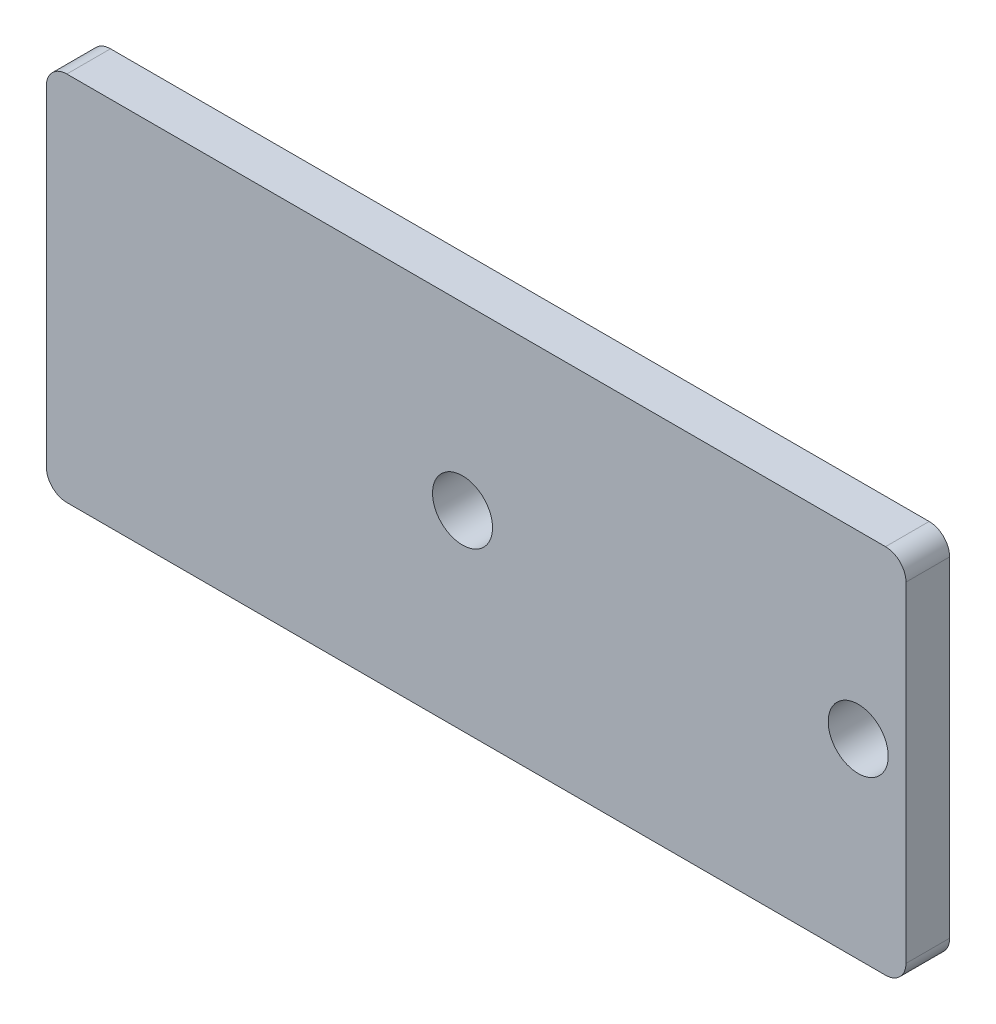
ISO-10303-21;
HEADER;
FILE_DESCRIPTION(('STEP AP214'),'2;1');
FILE_NAME('part.step','',(''),(''),'','','');
FILE_SCHEMA(('AUTOMOTIVE_DESIGN { 1 0 10303 214 1 1 1 1 }'));
ENDSEC;
DATA;
#1=APPLICATION_CONTEXT('core data for automotive mechanical design processes');
#2=APPLICATION_PROTOCOL_DEFINITION('international standard','automotive_design',2000,#1);
#3=PRODUCT_CONTEXT('',#1,'mechanical');
#4=PRODUCT('Part','Part','',(#3));
#5=PRODUCT_RELATED_PRODUCT_CATEGORY('part','',(#4));
#6=PRODUCT_DEFINITION_FORMATION('','',#4);
#7=PRODUCT_DEFINITION_CONTEXT('part definition',#1,'design');
#8=PRODUCT_DEFINITION('design','',#6,#7);
#9=PRODUCT_DEFINITION_SHAPE('','',#8);
#10=(LENGTH_UNIT() NAMED_UNIT(*) SI_UNIT(.MILLI.,.METRE.));
#11=(NAMED_UNIT(*) PLANE_ANGLE_UNIT() SI_UNIT($,.RADIAN.));
#12=(NAMED_UNIT(*) SI_UNIT($,.STERADIAN.) SOLID_ANGLE_UNIT());
#13=UNCERTAINTY_MEASURE_WITH_UNIT(LENGTH_MEASURE(1.E-05),#10,'distance_accuracy_value','');
#14=(GEOMETRIC_REPRESENTATION_CONTEXT(3) GLOBAL_UNCERTAINTY_ASSIGNED_CONTEXT((#13)) GLOBAL_UNIT_ASSIGNED_CONTEXT((#10,
#11,#12)) REPRESENTATION_CONTEXT('',''));
#15=CARTESIAN_POINT('',(0.,0.,0.));
#16=DIRECTION('',(0.,0.,1.));
#17=DIRECTION('',(1.,0.,0.));
#18=AXIS2_PLACEMENT_3D('',#15,#16,#17);
#19=CARTESIAN_POINT('',(-15.,6.05,0.8));
#20=DIRECTION('',(0.,0.,1.));
#21=DIRECTION('',(1.,0.,0.));
#22=AXIS2_PLACEMENT_3D('',#19,#20,#21);
#23=PLANE('',#22);
#24=CARTESIAN_POINT('',(-0.5,0.200000000000001,0.8));
#25=DIRECTION('',(0.,0.,1.));
#26=DIRECTION('',(1.,0.,0.));
#27=AXIS2_PLACEMENT_3D('',#24,#25,#26);
#28=CIRCLE('',#27,1.1);
#29=CARTESIAN_POINT('',(0.599999999999999,0.200000000000001,0.8));
#30=VERTEX_POINT('',#29);
#31=EDGE_CURVE('E137',#30,#30,#28,.T.);
#32=ORIENTED_EDGE('',*,*,#31,.F.);
#33=EDGE_LOOP('',(#32));
#34=FACE_BOUND('',#33,.T.);
#35=CARTESIAN_POINT('',(-15.,6.05,0.8));
#36=DIRECTION('',(0.,0.,1.));
#37=DIRECTION('',(1.,0.,0.));
#38=AXIS2_PLACEMENT_3D('',#35,#36,#37);
#39=CIRCLE('',#38,0.750000000000002);
#40=CARTESIAN_POINT('',(-15.,6.8,0.8));
#41=VERTEX_POINT('',#40);
#42=CARTESIAN_POINT('',(-15.75,6.05,0.8));
#43=VERTEX_POINT('',#42);
#44=EDGE_CURVE('E148',#41,#43,#39,.T.);
#45=ORIENTED_EDGE('',*,*,#44,.T.);
#46=DIRECTION('',(0.,-1.,0.));
#47=VECTOR('',#46,1.);
#48=CARTESIAN_POINT('',(-15.75,6.05,0.8));
#49=LINE('',#48,#47);
#50=CARTESIAN_POINT('',(-15.75,-6.05,0.8));
#51=VERTEX_POINT('',#50);
#52=EDGE_CURVE('E96',#43,#51,#49,.T.);
#53=ORIENTED_EDGE('',*,*,#52,.T.);
#54=CARTESIAN_POINT('',(-15.,-6.05,0.8));
#55=DIRECTION('',(0.,0.,1.));
#56=DIRECTION('',(-1.,0.,0.));
#57=AXIS2_PLACEMENT_3D('',#54,#55,#56);
#58=CIRCLE('',#57,0.750000000000002);
#59=CARTESIAN_POINT('',(-15.,-6.8,0.8));
#60=VERTEX_POINT('',#59);
#61=EDGE_CURVE('E163',#51,#60,#58,.T.);
#62=ORIENTED_EDGE('',*,*,#61,.T.);
#63=DIRECTION('',(1.,0.,0.));
#64=VECTOR('',#63,1.);
#65=CARTESIAN_POINT('',(-15.,-6.8,0.8));
#66=LINE('',#65,#64);
#67=CARTESIAN_POINT('',(15.,-6.8,0.8));
#68=VERTEX_POINT('',#67);
#69=EDGE_CURVE('E176',#60,#68,#66,.T.);
#70=ORIENTED_EDGE('',*,*,#69,.T.);
#71=CARTESIAN_POINT('',(15.,-6.05,0.8));
#72=DIRECTION('',(0.,0.,1.));
#73=DIRECTION('',(1.,0.,0.));
#74=AXIS2_PLACEMENT_3D('',#71,#72,#73);
#75=CIRCLE('',#74,0.750000000000002);
#76=CARTESIAN_POINT('',(15.75,-6.05,0.8));
#77=VERTEX_POINT('',#76);
#78=EDGE_CURVE('E115',#68,#77,#75,.T.);
#79=ORIENTED_EDGE('',*,*,#78,.T.);
#80=DIRECTION('',(0.,1.,0.));
#81=VECTOR('',#80,1.);
#82=CARTESIAN_POINT('',(15.75,-6.05,0.8));
#83=LINE('',#82,#81);
#84=CARTESIAN_POINT('',(15.75,6.05,0.8));
#85=VERTEX_POINT('',#84);
#86=EDGE_CURVE('E109',#77,#85,#83,.T.);
#87=ORIENTED_EDGE('',*,*,#86,.T.);
#88=CARTESIAN_POINT('',(15.,6.05,0.8));
#89=DIRECTION('',(0.,0.,1.));
#90=DIRECTION('',(-1.,0.,0.));
#91=AXIS2_PLACEMENT_3D('',#88,#89,#90);
#92=CIRCLE('',#91,0.750000000000002);
#93=CARTESIAN_POINT('',(15.,6.8,0.8));
#94=VERTEX_POINT('',#93);
#95=EDGE_CURVE('E113',#85,#94,#92,.T.);
#96=ORIENTED_EDGE('',*,*,#95,.T.);
#97=DIRECTION('',(-1.,0.,0.));
#98=VECTOR('',#97,1.);
#99=CARTESIAN_POINT('',(-15.,6.8,0.8));
#100=LINE('',#99,#98);
#101=EDGE_CURVE('E53',#94,#41,#100,.T.);
#102=ORIENTED_EDGE('',*,*,#101,.T.);
#103=EDGE_LOOP('',(#45,#53,#62,#70,#79,#87,#96,#102));
#104=FACE_BOUND('',#103,.T.);
#105=CARTESIAN_POINT('',(14.,0.200000000000001,0.8));
#106=DIRECTION('',(0.,0.,1.));
#107=DIRECTION('',(1.,0.,0.));
#108=AXIS2_PLACEMENT_3D('',#105,#106,#107);
#109=CIRCLE('',#108,1.1);
#110=CARTESIAN_POINT('',(15.1,0.200000000000001,0.8));
#111=VERTEX_POINT('',#110);
#112=EDGE_CURVE('E185',#111,#111,#109,.T.);
#113=ORIENTED_EDGE('',*,*,#112,.F.);
#114=EDGE_LOOP('',(#113));
#115=FACE_BOUND('',#114,.T.);
#116=ADVANCED_FACE('F36',(#34,#104,#115),#23,.T.);
#117=CARTESIAN_POINT('',(-15.,6.05,-0.8));
#118=DIRECTION('',(0.,0.,1.));
#119=DIRECTION('',(1.,0.,0.));
#120=AXIS2_PLACEMENT_3D('',#117,#118,#119);
#121=PLANE('',#120);
#122=CARTESIAN_POINT('',(-15.,6.05,-0.8));
#123=DIRECTION('',(0.,0.,1.));
#124=DIRECTION('',(1.,0.,0.));
#125=AXIS2_PLACEMENT_3D('',#122,#123,#124);
#126=CIRCLE('',#125,0.750000000000002);
#127=CARTESIAN_POINT('',(-15.,6.8,-0.8));
#128=VERTEX_POINT('',#127);
#129=CARTESIAN_POINT('',(-15.75,6.05,-0.8));
#130=VERTEX_POINT('',#129);
#131=EDGE_CURVE('E133',#128,#130,#126,.T.);
#132=ORIENTED_EDGE('',*,*,#131,.F.);
#133=DIRECTION('',(-1.,0.,0.));
#134=VECTOR('',#133,1.);
#135=CARTESIAN_POINT('',(-15.,6.8,-0.8));
#136=LINE('',#135,#134);
#137=CARTESIAN_POINT('',(15.,6.8,-0.8));
#138=VERTEX_POINT('',#137);
#139=EDGE_CURVE('E88',#138,#128,#136,.T.);
#140=ORIENTED_EDGE('',*,*,#139,.F.);
#141=CARTESIAN_POINT('',(15.,6.05,-0.8));
#142=DIRECTION('',(0.,0.,1.));
#143=DIRECTION('',(-1.,0.,0.));
#144=AXIS2_PLACEMENT_3D('',#141,#142,#143);
#145=CIRCLE('',#144,0.750000000000002);
#146=CARTESIAN_POINT('',(15.75,6.05,-0.8));
#147=VERTEX_POINT('',#146);
#148=EDGE_CURVE('E82',#147,#138,#145,.T.);
#149=ORIENTED_EDGE('',*,*,#148,.F.);
#150=DIRECTION('',(0.,1.,0.));
#151=VECTOR('',#150,1.);
#152=CARTESIAN_POINT('',(15.75,-6.05,-0.8));
#153=LINE('',#152,#151);
#154=CARTESIAN_POINT('',(15.75,-6.05,-0.8));
#155=VERTEX_POINT('',#154);
#156=EDGE_CURVE('E123',#155,#147,#153,.T.);
#157=ORIENTED_EDGE('',*,*,#156,.F.);
#158=CARTESIAN_POINT('',(15.,-6.05,-0.8));
#159=DIRECTION('',(0.,0.,1.));
#160=DIRECTION('',(1.,0.,0.));
#161=AXIS2_PLACEMENT_3D('',#158,#159,#160);
#162=CIRCLE('',#161,0.750000000000002);
#163=CARTESIAN_POINT('',(15.,-6.8,-0.8));
#164=VERTEX_POINT('',#163);
#165=EDGE_CURVE('E143',#164,#155,#162,.T.);
#166=ORIENTED_EDGE('',*,*,#165,.F.);
#167=DIRECTION('',(1.,0.,0.));
#168=VECTOR('',#167,1.);
#169=CARTESIAN_POINT('',(-15.,-6.8,-0.8));
#170=LINE('',#169,#168);
#171=CARTESIAN_POINT('',(-15.,-6.8,-0.8));
#172=VERTEX_POINT('',#171);
#173=EDGE_CURVE('E141',#172,#164,#170,.T.);
#174=ORIENTED_EDGE('',*,*,#173,.F.);
#175=CARTESIAN_POINT('',(-15.,-6.05,-0.8));
#176=DIRECTION('',(0.,0.,1.));
#177=DIRECTION('',(-1.,0.,0.));
#178=AXIS2_PLACEMENT_3D('',#175,#176,#177);
#179=CIRCLE('',#178,0.750000000000002);
#180=CARTESIAN_POINT('',(-15.75,-6.05,-0.8));
#181=VERTEX_POINT('',#180);
#182=EDGE_CURVE('E139',#181,#172,#179,.T.);
#183=ORIENTED_EDGE('',*,*,#182,.F.);
#184=DIRECTION('',(0.,-1.,0.));
#185=VECTOR('',#184,1.);
#186=CARTESIAN_POINT('',(-15.75,6.05,-0.8));
#187=LINE('',#186,#185);
#188=EDGE_CURVE('E136',#130,#181,#187,.T.);
#189=ORIENTED_EDGE('',*,*,#188,.F.);
#190=EDGE_LOOP('',(#132,#140,#149,#157,#166,#174,#183,#189));
#191=FACE_BOUND('',#190,.T.);
#192=CARTESIAN_POINT('',(-0.5,0.200000000000001,-0.8));
#193=DIRECTION('',(0.,0.,1.));
#194=DIRECTION('',(1.,0.,0.));
#195=AXIS2_PLACEMENT_3D('',#192,#193,#194);
#196=CIRCLE('',#195,1.1);
#197=CARTESIAN_POINT('',(0.599999999999999,0.200000000000001,-0.8));
#198=VERTEX_POINT('',#197);
#199=EDGE_CURVE('E182',#198,#198,#196,.T.);
#200=ORIENTED_EDGE('',*,*,#199,.T.);
#201=EDGE_LOOP('',(#200));
#202=FACE_BOUND('',#201,.T.);
#203=CARTESIAN_POINT('',(14.,0.200000000000001,-0.8));
#204=DIRECTION('',(0.,0.,1.));
#205=DIRECTION('',(1.,0.,0.));
#206=AXIS2_PLACEMENT_3D('',#203,#204,#205);
#207=CIRCLE('',#206,1.1);
#208=CARTESIAN_POINT('',(15.1,0.200000000000001,-0.8));
#209=VERTEX_POINT('',#208);
#210=EDGE_CURVE('E188',#209,#209,#207,.T.);
#211=ORIENTED_EDGE('',*,*,#210,.T.);
#212=EDGE_LOOP('',(#211));
#213=FACE_BOUND('',#212,.T.);
#214=ADVANCED_FACE('F167',(#191,#202,#213),#121,.F.);
#215=CARTESIAN_POINT('',(-15.,6.05,0.8));
#216=DIRECTION('',(0.,0.,-1.));
#217=DIRECTION('',(-1.,0.,0.));
#218=AXIS2_PLACEMENT_3D('',#215,#216,#217);
#219=CYLINDRICAL_SURFACE('',#218,0.750000000000002);
#220=ORIENTED_EDGE('',*,*,#131,.T.);
#221=DIRECTION('',(0.,0.,-1.));
#222=VECTOR('',#221,1.);
#223=CARTESIAN_POINT('',(-15.75,6.05,0.8));
#224=LINE('',#223,#222);
#225=EDGE_CURVE('E11',#43,#130,#224,.T.);
#226=ORIENTED_EDGE('',*,*,#225,.F.);
#227=ORIENTED_EDGE('',*,*,#44,.F.);
#228=DIRECTION('',(0.,0.,-1.));
#229=VECTOR('',#228,1.);
#230=CARTESIAN_POINT('',(-15.,6.8,0.8));
#231=LINE('',#230,#229);
#232=EDGE_CURVE('E129',#41,#128,#231,.T.);
#233=ORIENTED_EDGE('',*,*,#232,.T.);
#234=EDGE_LOOP('',(#220,#226,#227,#233));
#235=FACE_BOUND('',#234,.T.);
#236=ADVANCED_FACE('F38',(#235),#219,.T.);
#237=CARTESIAN_POINT('',(-15.75,6.05,0.8));
#238=DIRECTION('',(1.,0.,0.));
#239=DIRECTION('',(0.,0.,-1.));
#240=AXIS2_PLACEMENT_3D('',#237,#238,#239);
#241=PLANE('',#240);
#242=ORIENTED_EDGE('',*,*,#188,.T.);
#243=DIRECTION('',(0.,0.,-1.));
#244=VECTOR('',#243,1.);
#245=CARTESIAN_POINT('',(-15.75,-6.05,0.8));
#246=LINE('',#245,#244);
#247=EDGE_CURVE('E45',#51,#181,#246,.T.);
#248=ORIENTED_EDGE('',*,*,#247,.F.);
#249=ORIENTED_EDGE('',*,*,#52,.F.);
#250=ORIENTED_EDGE('',*,*,#225,.T.);
#251=EDGE_LOOP('',(#242,#248,#249,#250));
#252=FACE_BOUND('',#251,.T.);
#253=ADVANCED_FACE('F220',(#252),#241,.F.);
#254=CARTESIAN_POINT('',(-15.,-6.05,0.8));
#255=DIRECTION('',(0.,0.,-1.));
#256=DIRECTION('',(-1.,0.,0.));
#257=AXIS2_PLACEMENT_3D('',#254,#255,#256);
#258=CYLINDRICAL_SURFACE('',#257,0.750000000000002);
#259=ORIENTED_EDGE('',*,*,#182,.T.);
#260=DIRECTION('',(0.,0.,-1.));
#261=VECTOR('',#260,1.);
#262=CARTESIAN_POINT('',(-15.,-6.8,0.8));
#263=LINE('',#262,#261);
#264=EDGE_CURVE('E155',#60,#172,#263,.T.);
#265=ORIENTED_EDGE('',*,*,#264,.F.);
#266=ORIENTED_EDGE('',*,*,#61,.F.);
#267=ORIENTED_EDGE('',*,*,#247,.T.);
#268=EDGE_LOOP('',(#259,#265,#266,#267));
#269=FACE_BOUND('',#268,.T.);
#270=ADVANCED_FACE('F161',(#269),#258,.T.);
#271=CARTESIAN_POINT('',(-15.,-6.8,0.8));
#272=DIRECTION('',(0.,1.,0.));
#273=DIRECTION('',(0.,0.,1.));
#274=AXIS2_PLACEMENT_3D('',#271,#272,#273);
#275=PLANE('',#274);
#276=ORIENTED_EDGE('',*,*,#173,.T.);
#277=DIRECTION('',(0.,0.,-1.));
#278=VECTOR('',#277,1.);
#279=CARTESIAN_POINT('',(15.,-6.8,0.8));
#280=LINE('',#279,#278);
#281=EDGE_CURVE('E152',#68,#164,#280,.T.);
#282=ORIENTED_EDGE('',*,*,#281,.F.);
#283=ORIENTED_EDGE('',*,*,#69,.F.);
#284=ORIENTED_EDGE('',*,*,#264,.T.);
#285=EDGE_LOOP('',(#276,#282,#283,#284));
#286=FACE_BOUND('',#285,.T.);
#287=ADVANCED_FACE('F172',(#286),#275,.F.);
#288=CARTESIAN_POINT('',(15.,-6.05,0.8));
#289=DIRECTION('',(0.,0.,-1.));
#290=DIRECTION('',(-1.,0.,0.));
#291=AXIS2_PLACEMENT_3D('',#288,#289,#290);
#292=CYLINDRICAL_SURFACE('',#291,0.750000000000002);
#293=ORIENTED_EDGE('',*,*,#165,.T.);
#294=DIRECTION('',(0.,0.,-1.));
#295=VECTOR('',#294,1.);
#296=CARTESIAN_POINT('',(15.75,-6.05,0.8));
#297=LINE('',#296,#295);
#298=EDGE_CURVE('E124',#77,#155,#297,.T.);
#299=ORIENTED_EDGE('',*,*,#298,.F.);
#300=ORIENTED_EDGE('',*,*,#78,.F.);
#301=ORIENTED_EDGE('',*,*,#281,.T.);
#302=EDGE_LOOP('',(#293,#299,#300,#301));
#303=FACE_BOUND('',#302,.T.);
#304=ADVANCED_FACE('F175',(#303),#292,.T.);
#305=CARTESIAN_POINT('',(15.75,-6.05,0.8));
#306=DIRECTION('',(-1.,0.,0.));
#307=DIRECTION('',(0.,0.,1.));
#308=AXIS2_PLACEMENT_3D('',#305,#306,#307);
#309=PLANE('',#308);
#310=ORIENTED_EDGE('',*,*,#156,.T.);
#311=DIRECTION('',(0.,0.,-1.));
#312=VECTOR('',#311,1.);
#313=CARTESIAN_POINT('',(15.75,6.05,0.8));
#314=LINE('',#313,#312);
#315=EDGE_CURVE('E120',#85,#147,#314,.T.);
#316=ORIENTED_EDGE('',*,*,#315,.F.);
#317=ORIENTED_EDGE('',*,*,#86,.F.);
#318=ORIENTED_EDGE('',*,*,#298,.T.);
#319=EDGE_LOOP('',(#310,#316,#317,#318));
#320=FACE_BOUND('',#319,.T.);
#321=ADVANCED_FACE('F121',(#320),#309,.F.);
#322=CARTESIAN_POINT('',(15.,6.05,0.8));
#323=DIRECTION('',(0.,0.,-1.));
#324=DIRECTION('',(-1.,0.,0.));
#325=AXIS2_PLACEMENT_3D('',#322,#323,#324);
#326=CYLINDRICAL_SURFACE('',#325,0.750000000000002);
#327=ORIENTED_EDGE('',*,*,#148,.T.);
#328=DIRECTION('',(0.,0.,-1.));
#329=VECTOR('',#328,1.);
#330=CARTESIAN_POINT('',(15.,6.8,0.8));
#331=LINE('',#330,#329);
#332=EDGE_CURVE('E125',#94,#138,#331,.T.);
#333=ORIENTED_EDGE('',*,*,#332,.F.);
#334=ORIENTED_EDGE('',*,*,#95,.F.);
#335=ORIENTED_EDGE('',*,*,#315,.T.);
#336=EDGE_LOOP('',(#327,#333,#334,#335));
#337=FACE_BOUND('',#336,.T.);
#338=ADVANCED_FACE('F127',(#337),#326,.T.);
#339=CARTESIAN_POINT('',(-15.,6.8,0.8));
#340=DIRECTION('',(0.,-1.,0.));
#341=DIRECTION('',(0.,0.,-1.));
#342=AXIS2_PLACEMENT_3D('',#339,#340,#341);
#343=PLANE('',#342);
#344=ORIENTED_EDGE('',*,*,#139,.T.);
#345=ORIENTED_EDGE('',*,*,#232,.F.);
#346=ORIENTED_EDGE('',*,*,#101,.F.);
#347=ORIENTED_EDGE('',*,*,#332,.T.);
#348=EDGE_LOOP('',(#344,#345,#346,#347));
#349=FACE_BOUND('',#348,.T.);
#350=ADVANCED_FACE('F208',(#349),#343,.F.);
#351=CARTESIAN_POINT('',(-0.5,0.200000000000001,0.8));
#352=DIRECTION('',(0.,0.,-1.));
#353=DIRECTION('',(-1.,0.,0.));
#354=AXIS2_PLACEMENT_3D('',#351,#352,#353);
#355=CYLINDRICAL_SURFACE('',#354,1.1);
#356=ORIENTED_EDGE('',*,*,#31,.T.);
#357=EDGE_LOOP('',(#356));
#358=FACE_BOUND('',#357,.T.);
#359=ORIENTED_EDGE('',*,*,#199,.F.);
#360=EDGE_LOOP('',(#359));
#361=FACE_BOUND('',#360,.T.);
#362=ADVANCED_FACE('F205',(#358,#361),#355,.F.);
#363=CARTESIAN_POINT('',(14.,0.200000000000001,0.8));
#364=DIRECTION('',(0.,0.,-1.));
#365=DIRECTION('',(-1.,0.,0.));
#366=AXIS2_PLACEMENT_3D('',#363,#364,#365);
#367=CYLINDRICAL_SURFACE('',#366,1.1);
#368=ORIENTED_EDGE('',*,*,#112,.T.);
#369=EDGE_LOOP('',(#368));
#370=FACE_BOUND('',#369,.T.);
#371=ORIENTED_EDGE('',*,*,#210,.F.);
#372=EDGE_LOOP('',(#371));
#373=FACE_BOUND('',#372,.T.);
#374=ADVANCED_FACE('F194',(#370,#373),#367,.F.);
#375=CLOSED_SHELL('',(#116,#214,#236,#253,#270,#287,#304,#321,#338,#350,#362,#374));
#376=MANIFOLD_SOLID_BREP('B2',#375);
#377=ADVANCED_BREP_SHAPE_REPRESENTATION('',(#18,#376),#14);
#378=SHAPE_DEFINITION_REPRESENTATION(#9,#377);
ENDSEC;
END-ISO-10303-21;
